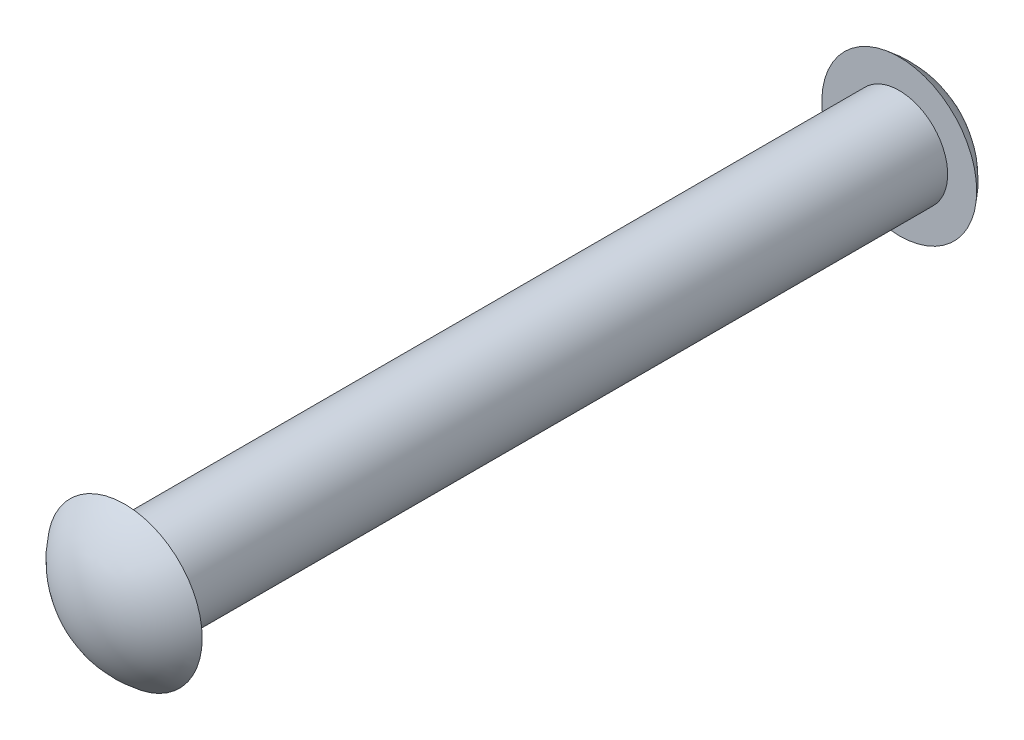
ISO-10303-21;
HEADER;
FILE_DESCRIPTION(('STEP AP214'),'2;1');
FILE_NAME('part.step','',(''),(''),'','','');
FILE_SCHEMA(('AUTOMOTIVE_DESIGN { 1 0 10303 214 1 1 1 1 }'));
ENDSEC;
DATA;
#1=APPLICATION_CONTEXT('core data for automotive mechanical design processes');
#2=APPLICATION_PROTOCOL_DEFINITION('international standard','automotive_design',2000,#1);
#3=PRODUCT_CONTEXT('',#1,'mechanical');
#4=PRODUCT('Part','Part','',(#3));
#5=PRODUCT_RELATED_PRODUCT_CATEGORY('part','',(#4));
#6=PRODUCT_DEFINITION_FORMATION('','',#4);
#7=PRODUCT_DEFINITION_CONTEXT('part definition',#1,'design');
#8=PRODUCT_DEFINITION('design','',#6,#7);
#9=PRODUCT_DEFINITION_SHAPE('','',#8);
#10=(LENGTH_UNIT() NAMED_UNIT(*) SI_UNIT(.MILLI.,.METRE.));
#11=(NAMED_UNIT(*) PLANE_ANGLE_UNIT() SI_UNIT($,.RADIAN.));
#12=(NAMED_UNIT(*) SI_UNIT($,.STERADIAN.) SOLID_ANGLE_UNIT());
#13=UNCERTAINTY_MEASURE_WITH_UNIT(LENGTH_MEASURE(1.E-05),#10,'distance_accuracy_value','');
#14=(GEOMETRIC_REPRESENTATION_CONTEXT(3) GLOBAL_UNCERTAINTY_ASSIGNED_CONTEXT((#13)) GLOBAL_UNIT_ASSIGNED_CONTEXT((#10,
#11,#12)) REPRESENTATION_CONTEXT('',''));
#15=CARTESIAN_POINT('',(0.,0.,0.));
#16=DIRECTION('',(0.,0.,1.));
#17=DIRECTION('',(1.,0.,0.));
#18=AXIS2_PLACEMENT_3D('',#15,#16,#17);
#19=CARTESIAN_POINT('',(0.,0.,50.8));
#20=DIRECTION('',(0.,0.,-1.));
#21=DIRECTION('',(-1.,0.,0.));
#22=AXIS2_PLACEMENT_3D('',#19,#20,#21);
#23=CYLINDRICAL_SURFACE('',#22,3.175);
#24=CARTESIAN_POINT('',(0.,0.,50.8));
#25=DIRECTION('',(0.,0.,1.));
#26=DIRECTION('',(1.,0.,0.));
#27=AXIS2_PLACEMENT_3D('',#24,#25,#26);
#28=CIRCLE('',#27,3.175);
#29=CARTESIAN_POINT('',(3.175,0.,50.8));
#30=VERTEX_POINT('',#29);
#31=EDGE_CURVE('E10',#30,#30,#28,.T.);
#32=ORIENTED_EDGE('',*,*,#31,.F.);
#33=EDGE_LOOP('',(#32));
#34=FACE_BOUND('',#33,.T.);
#35=CARTESIAN_POINT('',(0.,0.,0.));
#36=DIRECTION('',(0.,0.,-1.));
#37=DIRECTION('',(-1.,0.,0.));
#38=AXIS2_PLACEMENT_3D('',#35,#36,#37);
#39=CIRCLE('',#38,3.175);
#40=CARTESIAN_POINT('',(-3.175,0.,0.));
#41=VERTEX_POINT('',#40);
#42=EDGE_CURVE('E43',#41,#41,#39,.T.);
#43=ORIENTED_EDGE('',*,*,#42,.F.);
#44=EDGE_LOOP('',(#43));
#45=FACE_BOUND('',#44,.T.);
#46=ADVANCED_FACE('F33',(#34,#45),#23,.T.);
#47=CARTESIAN_POINT('',(0.,0.,46.99));
#48=DIRECTION('',(0.,0.,1.));
#49=DIRECTION('',(0.,1.,0.));
#50=AXIS2_PLACEMENT_3D('',#47,#48,#49);
#51=SPHERICAL_SURFACE('',#50,6.35);
#52=CARTESIAN_POINT('',(0.,0.,50.8));
#53=DIRECTION('',(0.,0.,1.));
#54=DIRECTION('',(1.,0.,0.));
#55=AXIS2_PLACEMENT_3D('',#52,#53,#54);
#56=CIRCLE('',#55,5.08);
#57=CARTESIAN_POINT('',(5.08,0.,50.8));
#58=VERTEX_POINT('',#57);
#59=EDGE_CURVE('E39',#58,#58,#56,.T.);
#60=ORIENTED_EDGE('',*,*,#59,.T.);
#61=EDGE_LOOP('',(#60));
#62=FACE_BOUND('',#61,.T.);
#63=ADVANCED_FACE('F65',(#62),#51,.T.);
#64=CARTESIAN_POINT('',(0.,0.,50.8));
#65=DIRECTION('',(0.,0.,1.));
#66=DIRECTION('',(1.,0.,0.));
#67=AXIS2_PLACEMENT_3D('',#64,#65,#66);
#68=PLANE('',#67);
#69=ORIENTED_EDGE('',*,*,#31,.T.);
#70=EDGE_LOOP('',(#69));
#71=FACE_BOUND('',#70,.T.);
#72=ORIENTED_EDGE('',*,*,#59,.F.);
#73=EDGE_LOOP('',(#72));
#74=FACE_BOUND('',#73,.T.);
#75=ADVANCED_FACE('F61',(#71,#74),#68,.F.);
#76=CARTESIAN_POINT('',(0.,0.,0.));
#77=DIRECTION('',(0.,0.,-1.));
#78=DIRECTION('',(-1.,0.,0.));
#79=AXIS2_PLACEMENT_3D('',#76,#77,#78);
#80=PLANE('',#79);
#81=ORIENTED_EDGE('',*,*,#42,.T.);
#82=EDGE_LOOP('',(#81));
#83=FACE_BOUND('',#82,.T.);
#84=CARTESIAN_POINT('',(0.,0.,0.));
#85=DIRECTION('',(0.,0.,1.));
#86=DIRECTION('',(1.,0.,0.));
#87=AXIS2_PLACEMENT_3D('',#84,#85,#86);
#88=CIRCLE('',#87,5.08);
#89=CARTESIAN_POINT('',(5.08,0.,0.));
#90=VERTEX_POINT('',#89);
#91=EDGE_CURVE('E47',#90,#90,#88,.T.);
#92=ORIENTED_EDGE('',*,*,#91,.T.);
#93=EDGE_LOOP('',(#92));
#94=FACE_BOUND('',#93,.T.);
#95=ADVANCED_FACE('F53',(#83,#94),#80,.F.);
#96=CARTESIAN_POINT('',(0.,0.,3.80999999999999));
#97=DIRECTION('',(0.,0.,1.));
#98=DIRECTION('',(0.,-1.,0.));
#99=AXIS2_PLACEMENT_3D('',#96,#97,#98);
#100=SPHERICAL_SURFACE('',#99,6.35);
#101=ORIENTED_EDGE('',*,*,#91,.F.);
#102=EDGE_LOOP('',(#101));
#103=FACE_BOUND('',#102,.T.);
#104=ADVANCED_FACE('F55',(#103),#100,.T.);
#105=CLOSED_SHELL('',(#46,#63,#75,#95,#104));
#106=MANIFOLD_SOLID_BREP('B2',#105);
#107=ADVANCED_BREP_SHAPE_REPRESENTATION('',(#18,#106),#14);
#108=SHAPE_DEFINITION_REPRESENTATION(#9,#107);
ENDSEC;
END-ISO-10303-21;
